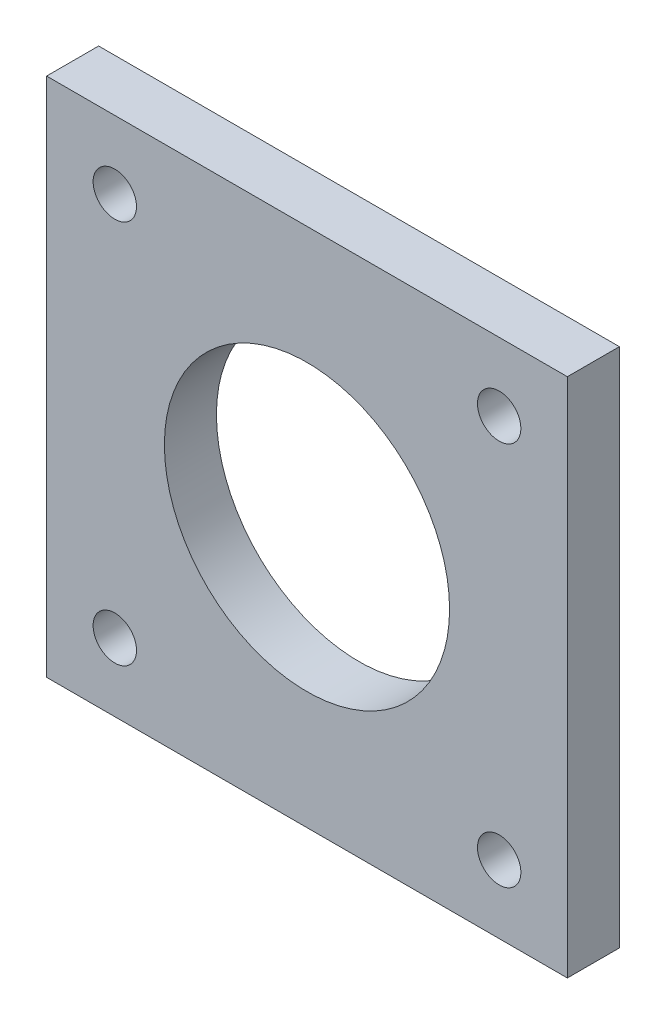
ISO-10303-21;
HEADER;
FILE_DESCRIPTION(('STEP AP214'),'2;1');
FILE_NAME('part.step','',(''),(''),'','','');
FILE_SCHEMA(('AUTOMOTIVE_DESIGN { 1 0 10303 214 1 1 1 1 }'));
ENDSEC;
DATA;
#1=APPLICATION_CONTEXT('core data for automotive mechanical design processes');
#2=APPLICATION_PROTOCOL_DEFINITION('international standard','automotive_design',2000,#1);
#3=PRODUCT_CONTEXT('',#1,'mechanical');
#4=PRODUCT('Part','Part','',(#3));
#5=PRODUCT_RELATED_PRODUCT_CATEGORY('part','',(#4));
#6=PRODUCT_DEFINITION_FORMATION('','',#4);
#7=PRODUCT_DEFINITION_CONTEXT('part definition',#1,'design');
#8=PRODUCT_DEFINITION('design','',#6,#7);
#9=PRODUCT_DEFINITION_SHAPE('','',#8);
#10=(LENGTH_UNIT() NAMED_UNIT(*) SI_UNIT(.MILLI.,.METRE.));
#11=(NAMED_UNIT(*) PLANE_ANGLE_UNIT() SI_UNIT($,.RADIAN.));
#12=(NAMED_UNIT(*) SI_UNIT($,.STERADIAN.) SOLID_ANGLE_UNIT());
#13=UNCERTAINTY_MEASURE_WITH_UNIT(LENGTH_MEASURE(1.E-05),#10,'distance_accuracy_value','');
#14=(GEOMETRIC_REPRESENTATION_CONTEXT(3) GLOBAL_UNCERTAINTY_ASSIGNED_CONTEXT((#13)) GLOBAL_UNIT_ASSIGNED_CONTEXT((#10,
#11,#12)) REPRESENTATION_CONTEXT('',''));
#15=CARTESIAN_POINT('',(0.,0.,0.));
#16=DIRECTION('',(0.,0.,1.));
#17=DIRECTION('',(1.,0.,0.));
#18=AXIS2_PLACEMENT_3D('',#15,#16,#17);
#19=CARTESIAN_POINT('',(0.,-21.0000000000015,4.19608));
#20=DIRECTION('',(0.,1.,0.));
#21=DIRECTION('',(0.,0.,1.));
#22=AXIS2_PLACEMENT_3D('',#19,#20,#21);
#23=PLANE('',#22);
#24=DIRECTION('',(1.,0.,0.));
#25=VECTOR('',#24,1.);
#26=CARTESIAN_POINT('',(0.,-21.0000000000015,0.));
#27=LINE('',#26,#25);
#28=CARTESIAN_POINT('',(-21.0000000000015,-21.0000000000015,0.));
#29=VERTEX_POINT('',#28);
#30=CARTESIAN_POINT('',(21.0000000000015,-21.0000000000015,0.));
#31=VERTEX_POINT('',#30);
#32=EDGE_CURVE('E114',#29,#31,#27,.T.);
#33=ORIENTED_EDGE('',*,*,#32,.T.);
#34=DIRECTION('',(0.,0.,-1.));
#35=VECTOR('',#34,1.);
#36=CARTESIAN_POINT('',(21.0000000000015,-21.0000000000015,4.19608));
#37=LINE('',#36,#35);
#38=CARTESIAN_POINT('',(21.0000000000015,-21.0000000000015,4.19608));
#39=VERTEX_POINT('',#38);
#40=EDGE_CURVE('E11',#39,#31,#37,.T.);
#41=ORIENTED_EDGE('',*,*,#40,.F.);
#42=DIRECTION('',(1.,0.,0.));
#43=VECTOR('',#42,1.);
#44=CARTESIAN_POINT('',(0.,-21.0000000000015,4.19608));
#45=LINE('',#44,#43);
#46=CARTESIAN_POINT('',(-21.0000000000015,-21.0000000000015,4.19608));
#47=VERTEX_POINT('',#46);
#48=EDGE_CURVE('E85',#47,#39,#45,.T.);
#49=ORIENTED_EDGE('',*,*,#48,.F.);
#50=DIRECTION('',(0.,0.,-1.));
#51=VECTOR('',#50,1.);
#52=CARTESIAN_POINT('',(-21.0000000000015,-21.0000000000015,4.19608));
#53=LINE('',#52,#51);
#54=EDGE_CURVE('E52',#47,#29,#53,.T.);
#55=ORIENTED_EDGE('',*,*,#54,.T.);
#56=EDGE_LOOP('',(#33,#41,#49,#55));
#57=FACE_BOUND('',#56,.T.);
#58=ADVANCED_FACE('F35',(#57),#23,.F.);
#59=CARTESIAN_POINT('',(21.0000000000015,0.,4.19608));
#60=DIRECTION('',(-1.,0.,0.));
#61=DIRECTION('',(0.,0.,1.));
#62=AXIS2_PLACEMENT_3D('',#59,#60,#61);
#63=PLANE('',#62);
#64=DIRECTION('',(0.,1.,0.));
#65=VECTOR('',#64,1.);
#66=CARTESIAN_POINT('',(21.0000000000015,0.,0.));
#67=LINE('',#66,#65);
#68=CARTESIAN_POINT('',(21.0000000000015,21.0000000000015,0.));
#69=VERTEX_POINT('',#68);
#70=EDGE_CURVE('E90',#31,#69,#67,.T.);
#71=ORIENTED_EDGE('',*,*,#70,.T.);
#72=DIRECTION('',(0.,0.,-1.));
#73=VECTOR('',#72,1.);
#74=CARTESIAN_POINT('',(21.0000000000015,21.0000000000015,4.19608));
#75=LINE('',#74,#73);
#76=CARTESIAN_POINT('',(21.0000000000015,21.0000000000015,4.19608));
#77=VERTEX_POINT('',#76);
#78=EDGE_CURVE('E44',#77,#69,#75,.T.);
#79=ORIENTED_EDGE('',*,*,#78,.F.);
#80=DIRECTION('',(0.,1.,0.));
#81=VECTOR('',#80,1.);
#82=CARTESIAN_POINT('',(21.0000000000015,0.,4.19608));
#83=LINE('',#82,#81);
#84=EDGE_CURVE('E77',#39,#77,#83,.T.);
#85=ORIENTED_EDGE('',*,*,#84,.F.);
#86=ORIENTED_EDGE('',*,*,#40,.T.);
#87=EDGE_LOOP('',(#71,#79,#85,#86));
#88=FACE_BOUND('',#87,.T.);
#89=ADVANCED_FACE('F89',(#88),#63,.F.);
#90=CARTESIAN_POINT('',(0.,21.0000000000015,4.19608));
#91=DIRECTION('',(0.,1.,0.));
#92=DIRECTION('',(0.,0.,1.));
#93=AXIS2_PLACEMENT_3D('',#90,#91,#92);
#94=PLANE('',#93);
#95=DIRECTION('',(1.,0.,0.));
#96=VECTOR('',#95,1.);
#97=CARTESIAN_POINT('',(0.,21.0000000000015,0.));
#98=LINE('',#97,#96);
#99=CARTESIAN_POINT('',(-21.0000000000015,21.0000000000015,0.));
#100=VERTEX_POINT('',#99);
#101=EDGE_CURVE('E117',#100,#69,#98,.T.);
#102=ORIENTED_EDGE('',*,*,#101,.F.);
#103=DIRECTION('',(0.,0.,-1.));
#104=VECTOR('',#103,1.);
#105=CARTESIAN_POINT('',(-21.0000000000015,21.0000000000015,4.19608));
#106=LINE('',#105,#104);
#107=CARTESIAN_POINT('',(-21.0000000000015,21.0000000000015,4.19608));
#108=VERTEX_POINT('',#107);
#109=EDGE_CURVE('E66',#108,#100,#106,.T.);
#110=ORIENTED_EDGE('',*,*,#109,.F.);
#111=DIRECTION('',(1.,0.,0.));
#112=VECTOR('',#111,1.);
#113=CARTESIAN_POINT('',(0.,21.0000000000015,4.19608));
#114=LINE('',#113,#112);
#115=EDGE_CURVE('E84',#108,#77,#114,.T.);
#116=ORIENTED_EDGE('',*,*,#115,.T.);
#117=ORIENTED_EDGE('',*,*,#78,.T.);
#118=EDGE_LOOP('',(#102,#110,#116,#117));
#119=FACE_BOUND('',#118,.T.);
#120=ADVANCED_FACE('F93',(#119),#94,.T.);
#121=CARTESIAN_POINT('',(0.,0.,4.19608));
#122=DIRECTION('',(0.,0.,-1.));
#123=DIRECTION('',(-1.,0.,0.));
#124=AXIS2_PLACEMENT_3D('',#121,#122,#123);
#125=CYLINDRICAL_SURFACE('',#124,11.4999999999982);
#126=CARTESIAN_POINT('',(0.,0.,4.19608));
#127=DIRECTION('',(0.,0.,1.));
#128=DIRECTION('',(1.,0.,0.));
#129=AXIS2_PLACEMENT_3D('',#126,#127,#128);
#130=CIRCLE('',#129,11.4999999999982);
#131=CARTESIAN_POINT('',(11.4999999999982,0.,4.19608));
#132=VERTEX_POINT('',#131);
#133=EDGE_CURVE('E139',#132,#132,#130,.T.);
#134=ORIENTED_EDGE('',*,*,#133,.T.);
#135=EDGE_LOOP('',(#134));
#136=FACE_BOUND('',#135,.T.);
#137=CARTESIAN_POINT('',(0.,0.,0.));
#138=DIRECTION('',(0.,0.,1.));
#139=DIRECTION('',(1.,0.,0.));
#140=AXIS2_PLACEMENT_3D('',#137,#138,#139);
#141=CIRCLE('',#140,11.4999999999982);
#142=CARTESIAN_POINT('',(11.4999999999982,0.,0.));
#143=VERTEX_POINT('',#142);
#144=EDGE_CURVE('E111',#143,#143,#141,.T.);
#145=ORIENTED_EDGE('',*,*,#144,.F.);
#146=EDGE_LOOP('',(#145));
#147=FACE_BOUND('',#146,.T.);
#148=ADVANCED_FACE('F143',(#136,#147),#125,.F.);
#149=CARTESIAN_POINT('',(-15.5,15.5,4.19608));
#150=DIRECTION('',(0.,0.,-1.));
#151=DIRECTION('',(-1.,0.,0.));
#152=AXIS2_PLACEMENT_3D('',#149,#150,#151);
#153=CYLINDRICAL_SURFACE('',#152,1.75);
#154=CARTESIAN_POINT('',(-15.5,15.5,4.19608));
#155=DIRECTION('',(0.,0.,1.));
#156=DIRECTION('',(1.,0.,0.));
#157=AXIS2_PLACEMENT_3D('',#154,#155,#156);
#158=CIRCLE('',#157,1.75);
#159=CARTESIAN_POINT('',(-13.75,15.5,4.19608));
#160=VERTEX_POINT('',#159);
#161=EDGE_CURVE('E136',#160,#160,#158,.T.);
#162=ORIENTED_EDGE('',*,*,#161,.T.);
#163=EDGE_LOOP('',(#162));
#164=FACE_BOUND('',#163,.T.);
#165=CARTESIAN_POINT('',(-15.5,15.5,0.));
#166=DIRECTION('',(0.,0.,1.));
#167=DIRECTION('',(1.,0.,0.));
#168=AXIS2_PLACEMENT_3D('',#165,#166,#167);
#169=CIRCLE('',#168,1.75);
#170=CARTESIAN_POINT('',(-13.75,15.5,0.));
#171=VERTEX_POINT('',#170);
#172=EDGE_CURVE('E108',#171,#171,#169,.T.);
#173=ORIENTED_EDGE('',*,*,#172,.F.);
#174=EDGE_LOOP('',(#173));
#175=FACE_BOUND('',#174,.T.);
#176=ADVANCED_FACE('F169',(#164,#175),#153,.F.);
#177=CARTESIAN_POINT('',(15.5,15.5,4.19608));
#178=DIRECTION('',(0.,0.,-1.));
#179=DIRECTION('',(-1.,0.,0.));
#180=AXIS2_PLACEMENT_3D('',#177,#178,#179);
#181=CYLINDRICAL_SURFACE('',#180,1.75);
#182=CARTESIAN_POINT('',(15.5,15.5,4.19608));
#183=DIRECTION('',(0.,0.,1.));
#184=DIRECTION('',(1.,0.,0.));
#185=AXIS2_PLACEMENT_3D('',#182,#183,#184);
#186=CIRCLE('',#185,1.75);
#187=CARTESIAN_POINT('',(17.25,15.5,4.19608));
#188=VERTEX_POINT('',#187);
#189=EDGE_CURVE('E131',#188,#188,#186,.T.);
#190=ORIENTED_EDGE('',*,*,#189,.T.);
#191=EDGE_LOOP('',(#190));
#192=FACE_BOUND('',#191,.T.);
#193=CARTESIAN_POINT('',(15.5,15.5,0.));
#194=DIRECTION('',(0.,0.,1.));
#195=DIRECTION('',(1.,0.,0.));
#196=AXIS2_PLACEMENT_3D('',#193,#194,#195);
#197=CIRCLE('',#196,1.75);
#198=CARTESIAN_POINT('',(17.25,15.5,0.));
#199=VERTEX_POINT('',#198);
#200=EDGE_CURVE('E105',#199,#199,#197,.T.);
#201=ORIENTED_EDGE('',*,*,#200,.F.);
#202=EDGE_LOOP('',(#201));
#203=FACE_BOUND('',#202,.T.);
#204=ADVANCED_FACE('F172',(#192,#203),#181,.F.);
#205=CARTESIAN_POINT('',(15.5,-15.5,4.19608));
#206=DIRECTION('',(0.,0.,-1.));
#207=DIRECTION('',(-1.,0.,0.));
#208=AXIS2_PLACEMENT_3D('',#205,#206,#207);
#209=CYLINDRICAL_SURFACE('',#208,1.75);
#210=CARTESIAN_POINT('',(15.5,-15.5,4.19608));
#211=DIRECTION('',(0.,0.,1.));
#212=DIRECTION('',(1.,0.,0.));
#213=AXIS2_PLACEMENT_3D('',#210,#211,#212);
#214=CIRCLE('',#213,1.75);
#215=CARTESIAN_POINT('',(17.25,-15.5,4.19608));
#216=VERTEX_POINT('',#215);
#217=EDGE_CURVE('E126',#216,#216,#214,.T.);
#218=ORIENTED_EDGE('',*,*,#217,.T.);
#219=EDGE_LOOP('',(#218));
#220=FACE_BOUND('',#219,.T.);
#221=CARTESIAN_POINT('',(15.5,-15.5,0.));
#222=DIRECTION('',(0.,0.,1.));
#223=DIRECTION('',(1.,0.,0.));
#224=AXIS2_PLACEMENT_3D('',#221,#222,#223);
#225=CIRCLE('',#224,1.75);
#226=CARTESIAN_POINT('',(17.25,-15.5,0.));
#227=VERTEX_POINT('',#226);
#228=EDGE_CURVE('E102',#227,#227,#225,.T.);
#229=ORIENTED_EDGE('',*,*,#228,.F.);
#230=EDGE_LOOP('',(#229));
#231=FACE_BOUND('',#230,.T.);
#232=ADVANCED_FACE('F175',(#220,#231),#209,.F.);
#233=CARTESIAN_POINT('',(-15.5,-15.5,4.19608));
#234=DIRECTION('',(0.,0.,-1.));
#235=DIRECTION('',(-1.,0.,0.));
#236=AXIS2_PLACEMENT_3D('',#233,#234,#235);
#237=CYLINDRICAL_SURFACE('',#236,1.75);
#238=CARTESIAN_POINT('',(-15.5,-15.5,4.19608));
#239=DIRECTION('',(0.,0.,1.));
#240=DIRECTION('',(1.,0.,0.));
#241=AXIS2_PLACEMENT_3D('',#238,#239,#240);
#242=CIRCLE('',#241,1.75);
#243=CARTESIAN_POINT('',(-13.75,-15.5,4.19608));
#244=VERTEX_POINT('',#243);
#245=EDGE_CURVE('E122',#244,#244,#242,.T.);
#246=ORIENTED_EDGE('',*,*,#245,.T.);
#247=EDGE_LOOP('',(#246));
#248=FACE_BOUND('',#247,.T.);
#249=CARTESIAN_POINT('',(-15.5,-15.5,0.));
#250=DIRECTION('',(0.,0.,1.));
#251=DIRECTION('',(1.,0.,0.));
#252=AXIS2_PLACEMENT_3D('',#249,#250,#251);
#253=CIRCLE('',#252,1.75);
#254=CARTESIAN_POINT('',(-13.75,-15.5,0.));
#255=VERTEX_POINT('',#254);
#256=EDGE_CURVE('E99',#255,#255,#253,.T.);
#257=ORIENTED_EDGE('',*,*,#256,.F.);
#258=EDGE_LOOP('',(#257));
#259=FACE_BOUND('',#258,.T.);
#260=ADVANCED_FACE('F37',(#248,#259),#237,.F.);
#261=CARTESIAN_POINT('',(-21.0000000000015,0.,4.19608));
#262=DIRECTION('',(-1.,0.,0.));
#263=DIRECTION('',(0.,0.,1.));
#264=AXIS2_PLACEMENT_3D('',#261,#262,#263);
#265=PLANE('',#264);
#266=DIRECTION('',(0.,1.,0.));
#267=VECTOR('',#266,1.);
#268=CARTESIAN_POINT('',(-21.0000000000015,0.,0.));
#269=LINE('',#268,#267);
#270=EDGE_CURVE('E119',#29,#100,#269,.T.);
#271=ORIENTED_EDGE('',*,*,#270,.F.);
#272=ORIENTED_EDGE('',*,*,#54,.F.);
#273=DIRECTION('',(0.,1.,0.));
#274=VECTOR('',#273,1.);
#275=CARTESIAN_POINT('',(-21.0000000000015,0.,4.19608));
#276=LINE('',#275,#274);
#277=EDGE_CURVE('E94',#47,#108,#276,.T.);
#278=ORIENTED_EDGE('',*,*,#277,.T.);
#279=ORIENTED_EDGE('',*,*,#109,.T.);
#280=EDGE_LOOP('',(#271,#272,#278,#279));
#281=FACE_BOUND('',#280,.T.);
#282=ADVANCED_FACE('F148',(#281),#265,.T.);
#283=CARTESIAN_POINT('',(0.,0.,4.19608));
#284=DIRECTION('',(0.,0.,1.));
#285=DIRECTION('',(1.,0.,0.));
#286=AXIS2_PLACEMENT_3D('',#283,#284,#285);
#287=PLANE('',#286);
#288=ORIENTED_EDGE('',*,*,#245,.F.);
#289=EDGE_LOOP('',(#288));
#290=FACE_BOUND('',#289,.T.);
#291=ORIENTED_EDGE('',*,*,#217,.F.);
#292=EDGE_LOOP('',(#291));
#293=FACE_BOUND('',#292,.T.);
#294=ORIENTED_EDGE('',*,*,#189,.F.);
#295=EDGE_LOOP('',(#294));
#296=FACE_BOUND('',#295,.T.);
#297=ORIENTED_EDGE('',*,*,#161,.F.);
#298=EDGE_LOOP('',(#297));
#299=FACE_BOUND('',#298,.T.);
#300=ORIENTED_EDGE('',*,*,#133,.F.);
#301=EDGE_LOOP('',(#300));
#302=FACE_BOUND('',#301,.T.);
#303=ORIENTED_EDGE('',*,*,#48,.T.);
#304=ORIENTED_EDGE('',*,*,#84,.T.);
#305=ORIENTED_EDGE('',*,*,#115,.F.);
#306=ORIENTED_EDGE('',*,*,#277,.F.);
#307=EDGE_LOOP('',(#303,#304,#305,#306));
#308=FACE_BOUND('',#307,.T.);
#309=ADVANCED_FACE('F81',(#290,#293,#296,#299,#302,#308),#287,.T.);
#310=CARTESIAN_POINT('',(0.,0.,0.));
#311=DIRECTION('',(0.,0.,1.));
#312=DIRECTION('',(1.,0.,0.));
#313=AXIS2_PLACEMENT_3D('',#310,#311,#312);
#314=PLANE('',#313);
#315=ORIENTED_EDGE('',*,*,#256,.T.);
#316=EDGE_LOOP('',(#315));
#317=FACE_BOUND('',#316,.T.);
#318=ORIENTED_EDGE('',*,*,#228,.T.);
#319=EDGE_LOOP('',(#318));
#320=FACE_BOUND('',#319,.T.);
#321=ORIENTED_EDGE('',*,*,#200,.T.);
#322=EDGE_LOOP('',(#321));
#323=FACE_BOUND('',#322,.T.);
#324=ORIENTED_EDGE('',*,*,#172,.T.);
#325=EDGE_LOOP('',(#324));
#326=FACE_BOUND('',#325,.T.);
#327=ORIENTED_EDGE('',*,*,#144,.T.);
#328=EDGE_LOOP('',(#327));
#329=FACE_BOUND('',#328,.T.);
#330=ORIENTED_EDGE('',*,*,#32,.F.);
#331=ORIENTED_EDGE('',*,*,#270,.T.);
#332=ORIENTED_EDGE('',*,*,#101,.T.);
#333=ORIENTED_EDGE('',*,*,#70,.F.);
#334=EDGE_LOOP('',(#330,#331,#332,#333));
#335=FACE_BOUND('',#334,.T.);
#336=ADVANCED_FACE('F147',(#317,#320,#323,#326,#329,#335),#314,.F.);
#337=CLOSED_SHELL('',(#58,#89,#120,#148,#176,#204,#232,#260,#282,#309,#336));
#338=MANIFOLD_SOLID_BREP('B2',#337);
#339=ADVANCED_BREP_SHAPE_REPRESENTATION('',(#18,#338),#14);
#340=SHAPE_DEFINITION_REPRESENTATION(#9,#339);
ENDSEC;
END-ISO-10303-21;
